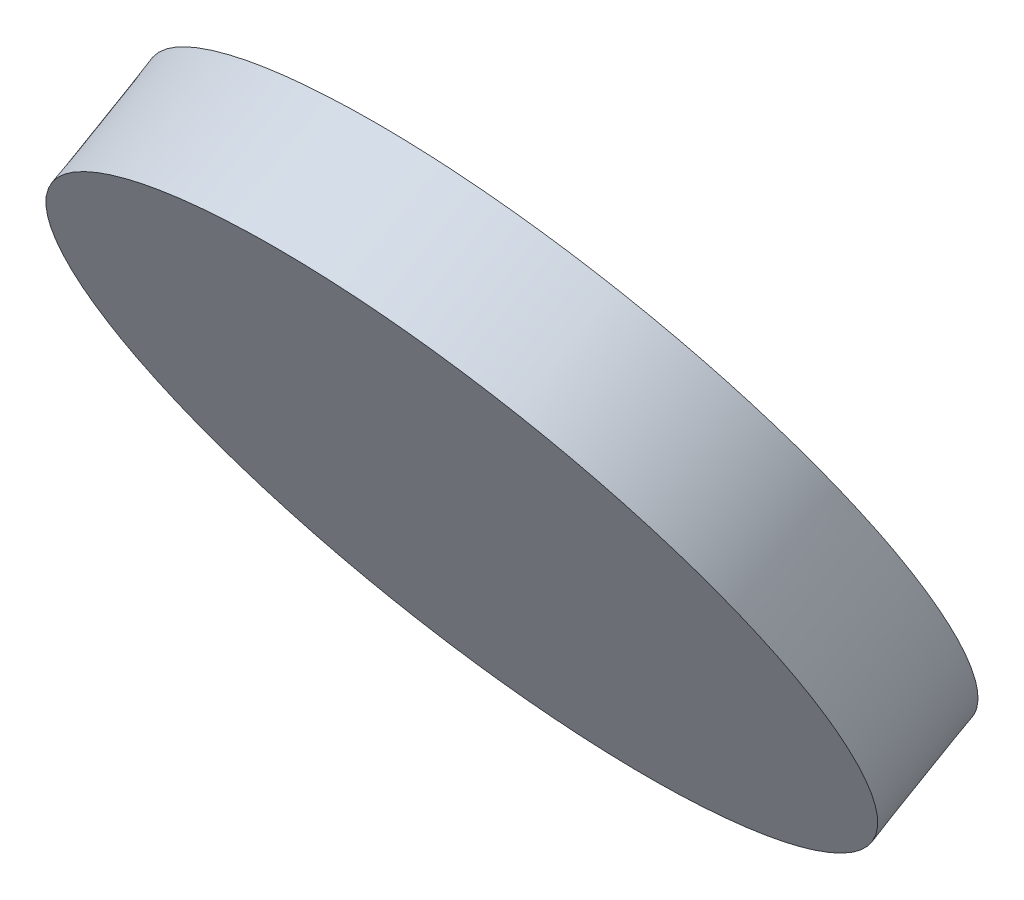
ISO-10303-21;
HEADER;
FILE_DESCRIPTION(('STEP AP214'),'2;1');
FILE_NAME('part.step','',(''),(''),'','','');
FILE_SCHEMA(('AUTOMOTIVE_DESIGN { 1 0 10303 214 1 1 1 1 }'));
ENDSEC;
DATA;
#1=APPLICATION_CONTEXT('core data for automotive mechanical design processes');
#2=APPLICATION_PROTOCOL_DEFINITION('international standard','automotive_design',2000,#1);
#3=PRODUCT_CONTEXT('',#1,'mechanical');
#4=PRODUCT('Part','Part','',(#3));
#5=PRODUCT_RELATED_PRODUCT_CATEGORY('part','',(#4));
#6=PRODUCT_DEFINITION_FORMATION('','',#4);
#7=PRODUCT_DEFINITION_CONTEXT('part definition',#1,'design');
#8=PRODUCT_DEFINITION('design','',#6,#7);
#9=PRODUCT_DEFINITION_SHAPE('','',#8);
#10=(LENGTH_UNIT() NAMED_UNIT(*) SI_UNIT(.MILLI.,.METRE.));
#11=(NAMED_UNIT(*) PLANE_ANGLE_UNIT() SI_UNIT($,.RADIAN.));
#12=(NAMED_UNIT(*) SI_UNIT($,.STERADIAN.) SOLID_ANGLE_UNIT());
#13=UNCERTAINTY_MEASURE_WITH_UNIT(LENGTH_MEASURE(1.E-05),#10,'distance_accuracy_value','');
#14=(GEOMETRIC_REPRESENTATION_CONTEXT(3) GLOBAL_UNCERTAINTY_ASSIGNED_CONTEXT((#13)) GLOBAL_UNIT_ASSIGNED_CONTEXT((#10,
#11,#12)) REPRESENTATION_CONTEXT('',''));
#15=CARTESIAN_POINT('',(0.,0.,0.));
#16=DIRECTION('',(0.,0.,1.));
#17=DIRECTION('',(1.,0.,0.));
#18=AXIS2_PLACEMENT_3D('',#15,#16,#17);
#19=CARTESIAN_POINT('',(-12.5,-8.26266717079047,-53.5328048076006));
#20=CARTESIAN_POINT('',(-12.3317700207924,-8.26266717079047,-53.5328048076006));
#21=CARTESIAN_POINT('',(-11.9953100623771,-8.32062682754336,-53.566267831029));
#22=CARTESIAN_POINT('',(-11.5674545927316,-8.56820953442885,-53.709209773496));
#23=CARTESIAN_POINT('',(-11.2815707077975,-8.93874324028998,-53.9231375083188));
#24=CARTESIAN_POINT('',(-11.1811816375123,-9.37581754730581,-54.1754824771302));
#25=CARTESIAN_POINT('',(-11.2815707077975,-9.81289185432164,-54.4278274459417));
#26=CARTESIAN_POINT('',(-11.5674545927316,-10.1834255601828,-54.6417551807644));
#27=CARTESIAN_POINT('',(-11.9953100623771,-10.4310082670682,-54.7846971232315));
#28=CARTESIAN_POINT('',(-12.5,-10.5179477521976,-54.8348916583741));
#29=CARTESIAN_POINT('',(-13.0046899376229,-10.4310082670682,-54.7846971232314));
#30=CARTESIAN_POINT('',(-13.4325454072684,-10.1834255601828,-54.6417551807644));
#31=CARTESIAN_POINT('',(-13.7184292922025,-9.81289185432163,-54.4278274459417));
#32=CARTESIAN_POINT('',(-13.8188183624877,-9.37581754730581,-54.1754824771302));
#33=CARTESIAN_POINT('',(-13.7184292922025,-8.93874324028998,-53.9231375083188));
#34=CARTESIAN_POINT('',(-13.4325454072684,-8.56820953442885,-53.7092097734961));
#35=CARTESIAN_POINT('',(-13.0046899376229,-8.32062682754336,-53.566267831029));
#36=CARTESIAN_POINT('',(-12.6682299792076,-8.26266717079047,-53.5328048076006));
#37=CARTESIAN_POINT('',(-12.5,-8.26266717079047,-53.5328048076006));
#38=B_SPLINE_CURVE_WITH_KNOTS('',3,(#19,#20,#21,#22,#23,#24,#25,#26,#27,#28,#29,#30,#31,#32,#33,
#34,#35,#36,#37),.UNSPECIFIED.,.T.,.F.,(4,1,1,1,1,1,1,1,1,1,1,1,1,1,1,1,4),(0.,
0.0624999999999999,0.125,0.1875,0.25,0.3125,0.375,0.4375,0.5,0.5625,0.625,0.6875,0.75,0.8125,
0.875,0.9375,1.),.UNSPECIFIED.);
#39=DIRECTION('',(0.,0.499999999999995,-0.866025403784442));
#40=VECTOR('',#39,1.);
#41=SURFACE_OF_LINEAR_EXTRUSION('',#38,#40);
#42=CARTESIAN_POINT('',(-12.5,-8.26266717079047,-53.5328048076006));
#43=CARTESIAN_POINT('',(-12.3317700207924,-8.26266717079047,-53.5328048076006));
#44=CARTESIAN_POINT('',(-11.9953100623771,-8.32062682754336,-53.566267831029));
#45=CARTESIAN_POINT('',(-11.5674545927316,-8.56820953442885,-53.709209773496));
#46=CARTESIAN_POINT('',(-11.2815707077975,-8.93874324028998,-53.9231375083188));
#47=CARTESIAN_POINT('',(-11.1811816375123,-9.3758175473058,-54.1754824771302));
#48=CARTESIAN_POINT('',(-11.2815707077975,-9.81289185432163,-54.4278274459417));
#49=CARTESIAN_POINT('',(-11.5674545927316,-10.1834255601828,-54.6417551807644));
#50=CARTESIAN_POINT('',(-11.9953100623771,-10.4310082670682,-54.7846971232315));
#51=CARTESIAN_POINT('',(-12.5,-10.5179477521976,-54.8348916583741));
#52=CARTESIAN_POINT('',(-13.0046899376229,-10.4310082670682,-54.7846971232315));
#53=CARTESIAN_POINT('',(-13.4325454072684,-10.1834255601828,-54.6417551807644));
#54=CARTESIAN_POINT('',(-13.7184292922025,-9.81289185432163,-54.4278274459417));
#55=CARTESIAN_POINT('',(-13.8188183624877,-9.3758175473058,-54.1754824771302));
#56=CARTESIAN_POINT('',(-13.7184292922025,-8.93874324028997,-53.9231375083188));
#57=CARTESIAN_POINT('',(-13.4325454072684,-8.56820953442885,-53.7092097734961));
#58=CARTESIAN_POINT('',(-13.0046899376229,-8.32062682754336,-53.566267831029));
#59=CARTESIAN_POINT('',(-12.6682299792076,-8.26266717079047,-53.5328048076006));
#60=CARTESIAN_POINT('',(-12.5,-8.26266717079047,-53.5328048076006));
#61=B_SPLINE_CURVE_WITH_KNOTS('',3,(#42,#43,#44,#45,#46,#47,#48,#49,#50,#51,#52,#53,#54,#55,#56,
#57,#58,#59,#60),.UNSPECIFIED.,.T.,.F.,(4,1,1,1,1,1,1,1,1,1,1,1,1,1,1,1,4),(0.,
0.0624999999999999,0.125,0.1875,0.25,0.3125,0.375,0.4375,0.5,0.5625,0.625,0.6875,0.75,0.8125,
0.875,0.9375,1.),.UNSPECIFIED.);
#62=CARTESIAN_POINT('',(-12.5,-8.26266717079047,-53.5328048076006));
#63=VERTEX_POINT('',#62);
#64=EDGE_CURVE('E10',#63,#63,#61,.T.);
#65=ORIENTED_EDGE('',*,*,#64,.T.);
#66=EDGE_LOOP('',(#65));
#67=FACE_BOUND('',#66,.T.);
#68=CARTESIAN_POINT('',(-12.5,-8.06266717079047,-53.8792149691144));
#69=CARTESIAN_POINT('',(-12.5210292435893,-8.06266715760592,-53.8792149615022));
#70=CARTESIAN_POINT('',(-12.5420580506909,-8.06312000040027,-53.8794764104115));
#71=CARTESIAN_POINT('',(-12.5840656469514,-8.06492263609273,-53.8805171626138));
#72=CARTESIAN_POINT('',(-12.605044433095,-8.06627248175939,-53.8812964963728));
#73=CARTESIAN_POINT('',(-12.6469017924796,-8.06986048239043,-53.883368029503));
#74=CARTESIAN_POINT('',(-12.6677803587443,-8.07209869831302,-53.8846602640684));
#75=CARTESIAN_POINT('',(-12.7093873858979,-8.07745482933055,-53.8877526277532));
#76=CARTESIAN_POINT('',(-12.7301158402734,-8.08057278236575,-53.8895527787774));
#77=CARTESIAN_POINT('',(-12.7713726611837,-8.08767981225891,-53.8936560243993));
#78=CARTESIAN_POINT('',(-12.7919010277185,-8.09166888911686,-53.8959591189971));
#79=CARTESIAN_POINT('',(-12.832707709252,-8.1005096065897,-53.9010633096098));
#80=CARTESIAN_POINT('',(-12.8529860349978,-8.10536120999344,-53.903864384141));
#81=CARTESIAN_POINT('',(-12.8932426430212,-8.11591841296738,-53.9099595881199));
#82=CARTESIAN_POINT('',(-12.9132209457939,-8.12162395390908,-53.9132536837184));
#83=CARTESIAN_POINT('',(-12.9528275830444,-8.13388047459254,-53.9203299892344));
#84=CARTESIAN_POINT('',(-12.9724559380415,-8.1404314045779,-53.9241121704249));
#85=CARTESIAN_POINT('',(-13.0113124478785,-8.1543699910942,-53.9321596171022));
#86=CARTESIAN_POINT('',(-13.0305406027184,-8.16175764762513,-53.936424882589));
#87=CARTESIAN_POINT('',(-13.06855413176,-8.17734499169158,-53.9454242398817));
#88=CARTESIAN_POINT('',(-13.0873394798451,-8.18554472697561,-53.9501583592552));
#89=CARTESIAN_POINT('',(-13.1244251203754,-8.20273169414932,-53.9600812593795));
#90=CARTESIAN_POINT('',(-13.1427253794428,-8.21171898004618,-53.9652700713114));
#91=CARTESIAN_POINT('',(-13.1787984767248,-8.23045653618613,-53.9760882043927));
#92=CARTESIAN_POINT('',(-13.1965712921558,-8.24020683932261,-53.9817175445332));
#93=CARTESIAN_POINT('',(-13.2315471338735,-8.26044594851342,-53.9934025996727));
#94=CARTESIAN_POINT('',(-13.2487501601601,-8.27093475456776,-53.9994583146717));
#95=CARTESIAN_POINT('',(-13.2825440403118,-8.2926264008623,-54.011981992499));
#96=CARTESIAN_POINT('',(-13.2991349205488,-8.3038292102856,-54.0184499375352));
#97=CARTESIAN_POINT('',(-13.331662109414,-8.32692438032456,-54.0317839401742));
#98=CARTESIAN_POINT('',(-13.3475984628843,-8.33881669356689,-54.0386499704259));
#99=CARTESIAN_POINT('',(-13.3787742546724,-8.36326641938701,-54.0527660262098));
#100=CARTESIAN_POINT('',(-13.3940137339341,-8.37582379279626,-54.0600160291279));
#101=CARTESIAN_POINT('',(-13.4237532190322,-8.40157894238665,-54.074885771677));
#102=CARTESIAN_POINT('',(-13.4382532248685,-8.41477671856779,-54.0825055113079));
#103=CARTESIAN_POINT('',(-13.4664853364362,-8.44177574623937,-54.0980934072019));
#104=CARTESIAN_POINT('',(-13.4802173969397,-8.45557703318831,-54.106061583937));
#105=CARTESIAN_POINT('',(-13.5068854022177,-8.48374640505931,-54.1223251783696));
#106=CARTESIAN_POINT('',(-13.5198212922901,-8.49811452881567,-54.1306206184881));
#107=CARTESIAN_POINT('',(-13.5448686479447,-8.52738088751947,-54.147517558564));
#108=CARTESIAN_POINT('',(-13.5569800779426,-8.5422791453057,-54.1561190717073));
#109=CARTESIAN_POINT('',(-13.5803501882216,-8.57256911275189,-54.1736069925661));
#110=CARTESIAN_POINT('',(-13.5916088685026,-8.58796082241186,-54.1824934002816));
#111=CARTESIAN_POINT('',(-13.6132451346653,-8.61920104105146,-54.2005299489227));
#112=CARTESIAN_POINT('',(-13.623622758529,-8.6350495303,-54.2096800784566));
#113=CARTESIAN_POINT('',(-13.6434685587776,-8.66716663711403,-54.2282228987212));
#114=CARTESIAN_POINT('',(-13.6529367975248,-8.6834352257735,-54.2376155727631));
#115=CARTESIAN_POINT('',(-13.67093551211,-8.71635590761411,-54.2566223372857));
#116=CARTESIAN_POINT('',(-13.6794660430833,-8.7330079781776,-54.2662364147081));
#117=CARTESIAN_POINT('',(-13.6955609364387,-8.76665870278725,-54.2856646696199));
#118=CARTESIAN_POINT('',(-13.7031252988208,-8.78365735683341,-54.2954788471093));
#119=CARTESIAN_POINT('',(-13.7172779098496,-8.81795771089412,-54.3152821657596));
#120=CARTESIAN_POINT('',(-13.7238661010426,-8.83525942867889,-54.32527131718));
#121=CARTESIAN_POINT('',(-13.7360565090117,-8.87012267373578,-54.3453996210985));
#122=CARTESIAN_POINT('',(-13.7416586580894,-8.88768421875711,-54.3555387838439));
#123=CARTESIAN_POINT('',(-13.7518670392729,-8.92302384221233,-54.3759421249588));
#124=CARTESIAN_POINT('',(-13.7564732284109,-8.94080192995338,-54.3862063087018));
#125=CARTESIAN_POINT('',(-13.7646797198118,-8.97653138269051,-54.4068347178576));
#126=CARTESIAN_POINT('',(-13.7682800220747,-8.99448274768658,-54.4171989432704));
#127=CARTESIAN_POINT('',(-13.7744647488583,-9.03051549857665,-54.4380024616964));
#128=CARTESIAN_POINT('',(-13.7770492171889,-9.04859687882925,-54.4484417514526));
#129=CARTESIAN_POINT('',(-13.7811922856357,-9.08484638404821,-54.4693704130487));
#130=CARTESIAN_POINT('',(-13.7827509561402,-9.10301450297655,-54.4798597814027));
#131=CARTESIAN_POINT('',(-13.7848324523857,-9.13939426545413,-54.5008636470622));
#132=CARTESIAN_POINT('',(-13.7853553390593,-9.15760590637997,-54.5113781428531));
#133=CARTESIAN_POINT('',(-13.7853553390593,-9.19402918823164,-54.5324071344349));
#134=CARTESIAN_POINT('',(-13.7848324523857,-9.21224082915747,-54.5429216302259));
#135=CARTESIAN_POINT('',(-13.7827509561402,-9.24862059163506,-54.5639254958853));
#136=CARTESIAN_POINT('',(-13.7811922856357,-9.2667887105634,-54.5744148642393));
#137=CARTESIAN_POINT('',(-13.7770492171889,-9.30303821578236,-54.5953435258354));
#138=CARTESIAN_POINT('',(-13.7744647488583,-9.32111959603495,-54.6057828155916));
#139=CARTESIAN_POINT('',(-13.7682800220747,-9.35715234692502,-54.6265863340176));
#140=CARTESIAN_POINT('',(-13.7646797198118,-9.3751037119211,-54.6369505594304));
#141=CARTESIAN_POINT('',(-13.7564732284109,-9.41083316465823,-54.6575789685862));
#142=CARTESIAN_POINT('',(-13.7518670392729,-9.42861125239928,-54.6678431523292));
#143=CARTESIAN_POINT('',(-13.7416586580894,-9.4639508758545,-54.6882464934441));
#144=CARTESIAN_POINT('',(-13.7360565090117,-9.48151242087583,-54.6983856561895));
#145=CARTESIAN_POINT('',(-13.7238661010426,-9.51637566593271,-54.718513960108));
#146=CARTESIAN_POINT('',(-13.7172779098496,-9.53367738371748,-54.7285031115284));
#147=CARTESIAN_POINT('',(-13.7031252988208,-9.56797773777819,-54.7483064301787));
#148=CARTESIAN_POINT('',(-13.6955609364387,-9.58497639182436,-54.7581206076681));
#149=CARTESIAN_POINT('',(-13.6794660430833,-9.618627116434,-54.7775488625799));
#150=CARTESIAN_POINT('',(-13.67093551211,-9.6352791869975,-54.7871629400023));
#151=CARTESIAN_POINT('',(-13.6529367975248,-9.6681998688381,-54.8061697045249));
#152=CARTESIAN_POINT('',(-13.6434685587776,-9.68446845749758,-54.8155623785668));
#153=CARTESIAN_POINT('',(-13.623622758529,-9.71658556431161,-54.8341051988315));
#154=CARTESIAN_POINT('',(-13.6132451346653,-9.73243405356014,-54.8432553283653));
#155=CARTESIAN_POINT('',(-13.5916088685026,-9.76367427219975,-54.8612918770065));
#156=CARTESIAN_POINT('',(-13.5803501882216,-9.77906598185971,-54.8701782847219));
#157=CARTESIAN_POINT('',(-13.5569800779426,-9.80935594930591,-54.8876662055807));
#158=CARTESIAN_POINT('',(-13.5448686479447,-9.82425420709214,-54.8962677187241));
#159=CARTESIAN_POINT('',(-13.5198212922901,-9.85352056579594,-54.9131646587999));
#160=CARTESIAN_POINT('',(-13.5068854022177,-9.86788868955229,-54.9214600989184));
#161=CARTESIAN_POINT('',(-13.4802173969397,-9.8960580614233,-54.937723693351));
#162=CARTESIAN_POINT('',(-13.4664853364362,-9.90985934837224,-54.9456918700862));
#163=CARTESIAN_POINT('',(-13.4382532248685,-9.93685837604382,-54.9612797659802));
#164=CARTESIAN_POINT('',(-13.4237532190322,-9.95005615222496,-54.9688995056111));
#165=CARTESIAN_POINT('',(-13.3940137339342,-9.97581130181535,-54.9837692481601));
#166=CARTESIAN_POINT('',(-13.3787742546724,-9.9883686752246,-54.9910192510783));
#167=CARTESIAN_POINT('',(-13.3475984628843,-10.0128184010447,-55.0051353068621));
#168=CARTESIAN_POINT('',(-13.331662109414,-10.024710714287,-55.0120013371139));
#169=CARTESIAN_POINT('',(-13.2991349205488,-10.047805884326,-55.0253353397528));
#170=CARTESIAN_POINT('',(-13.2825440403118,-10.0590086937493,-55.0318032847891));
#171=CARTESIAN_POINT('',(-13.2487501601601,-10.0807003400438,-55.0443269626164));
#172=CARTESIAN_POINT('',(-13.2315471338735,-10.0911891460982,-55.0503826776153));
#173=CARTESIAN_POINT('',(-13.1965712921558,-10.111428255289,-55.0620677327548));
#174=CARTESIAN_POINT('',(-13.1787984767249,-10.1211785584255,-55.0676970728953));
#175=CARTESIAN_POINT('',(-13.1427253794427,-10.1399161145654,-55.0785152059767));
#176=CARTESIAN_POINT('',(-13.1244251203749,-10.1489034004623,-55.0837040179085));
#177=CARTESIAN_POINT('',(-13.0873394798455,-10.166090367636,-55.0936269180328));
#178=CARTESIAN_POINT('',(-13.0685541317618,-10.1742901029201,-55.0983610374064));
#179=CARTESIAN_POINT('',(-13.0305406027166,-10.1898774469864,-55.107360394699));
#180=CARTESIAN_POINT('',(-13.0113124478718,-10.197265103517,-55.1116256601857));
#181=CARTESIAN_POINT('',(-12.9724559380482,-10.211203690034,-55.1196731068634));
#182=CARTESIAN_POINT('',(-12.9528275830694,-10.2177546200204,-55.1234552880544));
#183=CARTESIAN_POINT('',(-12.9132209457689,-10.2300111407012,-55.1305315935688));
#184=CARTESIAN_POINT('',(-12.8932426429279,-10.2357166816393,-55.1338256891653));
#185=CARTESIAN_POINT('',(-12.8529860350911,-10.246273884623,-55.1399208931499));
#186=CARTESIAN_POINT('',(-12.8327077096002,-10.2511254880401,-55.1427219676887));
#187=CARTESIAN_POINT('',(-12.7919010273703,-10.2599662054765,-55.1478261582804));
#188=CARTESIAN_POINT('',(-12.7713726598844,-10.2639552822847,-55.1501292528495));
#189=CARTESIAN_POINT('',(-12.7301158415728,-10.2710623123138,-55.1542324985499));
#190=CARTESIAN_POINT('',(-12.7093873907472,-10.2741802655348,-55.1560326496814));
#191=CARTESIAN_POINT('',(-12.6677803538952,-10.2795363960449,-55.1591250130732));
#192=CARTESIAN_POINT('',(-12.6469017743828,-10.2817746112744,-55.1604172472384));
#193=CARTESIAN_POINT('',(-12.6050444511905,-10.2853626137989,-55.1624887814618));
#194=CARTESIAN_POINT('',(-12.5840657144826,-10.286712462052,-55.1632681167141));
#195=CARTESIAN_POINT('',(-12.5420579831637,-10.2885150906784,-55.1643088648368));
#196=CARTESIAN_POINT('',(-12.5210289915818,-10.2889679238211,-55.1645703081737));
#197=CARTESIAN_POINT('',(-12.4789710084182,-10.2889679238211,-55.1645703081737));
#198=CARTESIAN_POINT('',(-12.4579420168363,-10.2885150906784,-55.1643088648368));
#199=CARTESIAN_POINT('',(-12.4159342855174,-10.286712462052,-55.1632681167141));
#200=CARTESIAN_POINT('',(-12.3949555488095,-10.2853626137989,-55.1624887814618));
#201=CARTESIAN_POINT('',(-12.3530982256172,-10.2817746112744,-55.1604172472384));
#202=CARTESIAN_POINT('',(-12.3322196461048,-10.2795363960449,-55.1591250130732));
#203=CARTESIAN_POINT('',(-12.2906126092528,-10.2741802655348,-55.1560326496814));
#204=CARTESIAN_POINT('',(-12.2698841584272,-10.2710623123138,-55.1542324985499));
#205=CARTESIAN_POINT('',(-12.2286273401156,-10.2639552822847,-55.1501292528495));
#206=CARTESIAN_POINT('',(-12.2080989726297,-10.2599662054765,-55.1478261582804));
#207=CARTESIAN_POINT('',(-12.1672922903998,-10.2511254880401,-55.1427219676887));
#208=CARTESIAN_POINT('',(-12.1470139649089,-10.246273884623,-55.1399208931499));
#209=CARTESIAN_POINT('',(-12.1067573570721,-10.2357166816393,-55.1338256891653));
#210=CARTESIAN_POINT('',(-12.0867790542311,-10.2300111407012,-55.1305315935688));
#211=CARTESIAN_POINT('',(-12.0471724169306,-10.2177546200204,-55.1234552880544));
#212=CARTESIAN_POINT('',(-12.0275440619518,-10.211203690034,-55.1196731068634));
#213=CARTESIAN_POINT('',(-11.9886875521282,-10.197265103517,-55.1116256601857));
#214=CARTESIAN_POINT('',(-11.9694593972834,-10.1898774469864,-55.107360394699));
#215=CARTESIAN_POINT('',(-11.9314458682382,-10.1742901029201,-55.0983610374064));
#216=CARTESIAN_POINT('',(-11.9126605201545,-10.166090367636,-55.0936269180328));
#217=CARTESIAN_POINT('',(-11.8755748796251,-10.1489034004623,-55.0837040179085));
#218=CARTESIAN_POINT('',(-11.8572746205573,-10.1399161145654,-55.0785152059767));
#219=CARTESIAN_POINT('',(-11.8212015232751,-10.1211785584255,-55.0676970728953));
#220=CARTESIAN_POINT('',(-11.8034287078442,-10.111428255289,-55.0620677327548));
#221=CARTESIAN_POINT('',(-11.7684528661265,-10.0911891460982,-55.0503826776153));
#222=CARTESIAN_POINT('',(-11.7512498398399,-10.0807003400438,-55.0443269626164));
#223=CARTESIAN_POINT('',(-11.7174559596882,-10.0590086937493,-55.0318032847891));
#224=CARTESIAN_POINT('',(-11.7008650794512,-10.047805884326,-55.0253353397528));
#225=CARTESIAN_POINT('',(-11.668337890586,-10.024710714287,-55.0120013371139));
#226=CARTESIAN_POINT('',(-11.6524015371157,-10.0128184010447,-55.0051353068621));
#227=CARTESIAN_POINT('',(-11.6212257453276,-9.9883686752246,-54.9910192510783));
#228=CARTESIAN_POINT('',(-11.6059862660658,-9.97581130181535,-54.9837692481601));
#229=CARTESIAN_POINT('',(-11.5762467809678,-9.95005615222496,-54.9688995056111));
#230=CARTESIAN_POINT('',(-11.5617467751315,-9.93685837604382,-54.9612797659802));
#231=CARTESIAN_POINT('',(-11.5335146635638,-9.90985934837224,-54.9456918700862));
#232=CARTESIAN_POINT('',(-11.5197826030603,-9.8960580614233,-54.937723693351));
#233=CARTESIAN_POINT('',(-11.4931145977823,-9.86788868955229,-54.9214600989184));
#234=CARTESIAN_POINT('',(-11.4801787077099,-9.85352056579594,-54.9131646587999));
#235=CARTESIAN_POINT('',(-11.4551313520553,-9.82425420709214,-54.8962677187241));
#236=CARTESIAN_POINT('',(-11.4430199220574,-9.80935594930591,-54.8876662055807));
#237=CARTESIAN_POINT('',(-11.4196498117784,-9.77906598185971,-54.8701782847219));
#238=CARTESIAN_POINT('',(-11.4083911314974,-9.76367427219975,-54.8612918770065));
#239=CARTESIAN_POINT('',(-11.3867548653347,-9.73243405356015,-54.8432553283653));
#240=CARTESIAN_POINT('',(-11.376377241471,-9.71658556431161,-54.8341051988315));
#241=CARTESIAN_POINT('',(-11.3565314412224,-9.68446845749758,-54.8155623785668));
#242=CARTESIAN_POINT('',(-11.3470632024752,-9.66819986883811,-54.8061697045249));
#243=CARTESIAN_POINT('',(-11.32906448789,-9.6352791869975,-54.7871629400023));
#244=CARTESIAN_POINT('',(-11.3205339569167,-9.61862711643401,-54.7775488625799));
#245=CARTESIAN_POINT('',(-11.3044390635613,-9.58497639182436,-54.7581206076681));
#246=CARTESIAN_POINT('',(-11.2968747011792,-9.5679777377782,-54.7483064301787));
#247=CARTESIAN_POINT('',(-11.2827220901504,-9.53367738371749,-54.7285031115284));
#248=CARTESIAN_POINT('',(-11.2761338989574,-9.51637566593271,-54.718513960108));
#249=CARTESIAN_POINT('',(-11.2639434909883,-9.48151242087583,-54.6983856561896));
#250=CARTESIAN_POINT('',(-11.2583413419106,-9.4639508758545,-54.6882464934441));
#251=CARTESIAN_POINT('',(-11.2481329607271,-9.42861125239928,-54.6678431523292));
#252=CARTESIAN_POINT('',(-11.2435267715891,-9.41083316465823,-54.6575789685862));
#253=CARTESIAN_POINT('',(-11.2353202801882,-9.3751037119211,-54.6369505594304));
#254=CARTESIAN_POINT('',(-11.2317199779253,-9.35715234692503,-54.6265863340176));
#255=CARTESIAN_POINT('',(-11.2255352511417,-9.32111959603496,-54.6057828155916));
#256=CARTESIAN_POINT('',(-11.2229507828111,-9.30303821578236,-54.5953435258354));
#257=CARTESIAN_POINT('',(-11.2188077143643,-9.2667887105634,-54.5744148642393));
#258=CARTESIAN_POINT('',(-11.2172490438598,-9.24862059163506,-54.5639254958853));
#259=CARTESIAN_POINT('',(-11.2151675476143,-9.21224082915748,-54.5429216302258));
#260=CARTESIAN_POINT('',(-11.2146446609407,-9.19402918823164,-54.5324071344349));
#261=CARTESIAN_POINT('',(-11.2146446609407,-9.15760590637997,-54.5113781428531));
#262=CARTESIAN_POINT('',(-11.2151675476143,-9.13939426545413,-54.5008636470622));
#263=CARTESIAN_POINT('',(-11.2172490438598,-9.10301450297655,-54.4798597814027));
#264=CARTESIAN_POINT('',(-11.2188077143643,-9.08484638404821,-54.4693704130487));
#265=CARTESIAN_POINT('',(-11.2229507828111,-9.04859687882925,-54.4484417514526));
#266=CARTESIAN_POINT('',(-11.2255352511416,-9.03051549857665,-54.4380024616964));
#267=CARTESIAN_POINT('',(-11.2317199779253,-8.99448274768658,-54.4171989432704));
#268=CARTESIAN_POINT('',(-11.2353202801882,-8.97653138269051,-54.4068347178576));
#269=CARTESIAN_POINT('',(-11.2435267715891,-8.94080192995338,-54.3862063087018));
#270=CARTESIAN_POINT('',(-11.2481329607271,-8.92302384221233,-54.3759421249589));
#271=CARTESIAN_POINT('',(-11.2583413419106,-8.88768421875711,-54.3555387838439));
#272=CARTESIAN_POINT('',(-11.2639434909883,-8.87012267373578,-54.3453996210985));
#273=CARTESIAN_POINT('',(-11.2761338989574,-8.83525942867889,-54.3252713171801));
#274=CARTESIAN_POINT('',(-11.2827220901504,-8.81795771089412,-54.3152821657596));
#275=CARTESIAN_POINT('',(-11.2968747011792,-8.78365735683341,-54.2954788471093));
#276=CARTESIAN_POINT('',(-11.3044390635613,-8.76665870278725,-54.2856646696199));
#277=CARTESIAN_POINT('',(-11.3205339569167,-8.7330079781776,-54.2662364147081));
#278=CARTESIAN_POINT('',(-11.32906448789,-8.71635590761411,-54.2566223372857));
#279=CARTESIAN_POINT('',(-11.3470632024752,-8.68343522577351,-54.2376155727631));
#280=CARTESIAN_POINT('',(-11.3565314412224,-8.66716663711403,-54.2282228987212));
#281=CARTESIAN_POINT('',(-11.376377241471,-8.6350495303,-54.2096800784566));
#282=CARTESIAN_POINT('',(-11.3867548653347,-8.61920104105146,-54.2005299489227));
#283=CARTESIAN_POINT('',(-11.4083911314974,-8.58796082241186,-54.1824934002816));
#284=CARTESIAN_POINT('',(-11.4196498117784,-8.57256911275189,-54.1736069925661));
#285=CARTESIAN_POINT('',(-11.4430199220574,-8.5422791453057,-54.1561190717073));
#286=CARTESIAN_POINT('',(-11.4551313520553,-8.52738088751947,-54.147517558564));
#287=CARTESIAN_POINT('',(-11.4801787077099,-8.49811452881567,-54.1306206184881));
#288=CARTESIAN_POINT('',(-11.4931145977823,-8.48374640505931,-54.1223251783696));
#289=CARTESIAN_POINT('',(-11.5197826030603,-8.45557703318831,-54.106061583937));
#290=CARTESIAN_POINT('',(-11.5335146635638,-8.44177574623937,-54.0980934072019));
#291=CARTESIAN_POINT('',(-11.5617467751315,-8.41477671856779,-54.0825055113078));
#292=CARTESIAN_POINT('',(-11.5762467809678,-8.40157894238665,-54.074885771677));
#293=CARTESIAN_POINT('',(-11.6059862660659,-8.37582379279626,-54.0600160291279));
#294=CARTESIAN_POINT('',(-11.6212257453276,-8.36326641938701,-54.0527660262098));
#295=CARTESIAN_POINT('',(-11.6524015371157,-8.33881669356689,-54.0386499704259));
#296=CARTESIAN_POINT('',(-11.668337890586,-8.32692438032456,-54.0317839401742));
#297=CARTESIAN_POINT('',(-11.7008650794512,-8.3038292102856,-54.0184499375352));
#298=CARTESIAN_POINT('',(-11.7174559596882,-8.2926264008623,-54.011981992499));
#299=CARTESIAN_POINT('',(-11.7512498398399,-8.27093475456776,-53.9994583146716));
#300=CARTESIAN_POINT('',(-11.7684528661265,-8.26044594851342,-53.9934025996727));
#301=CARTESIAN_POINT('',(-11.8034287078442,-8.24020683932261,-53.9817175445332));
#302=CARTESIAN_POINT('',(-11.8212015232752,-8.23045653618613,-53.9760882043927));
#303=CARTESIAN_POINT('',(-11.8572746205572,-8.21171898004618,-53.9652700713114));
#304=CARTESIAN_POINT('',(-11.8755748796246,-8.20273169414932,-53.9600812593795));
#305=CARTESIAN_POINT('',(-11.9126605201549,-8.18554472697561,-53.9501583592552));
#306=CARTESIAN_POINT('',(-11.93144586824,-8.17734499169158,-53.9454242398817));
#307=CARTESIAN_POINT('',(-11.9694593972816,-8.16175764762514,-53.936424882589));
#308=CARTESIAN_POINT('',(-11.9886875521215,-8.1543699910942,-53.9321596171022));
#309=CARTESIAN_POINT('',(-12.0275440619585,-8.14043140457791,-53.9241121704249));
#310=CARTESIAN_POINT('',(-12.0471724169556,-8.13388047459254,-53.9203299892344));
#311=CARTESIAN_POINT('',(-12.0867790542061,-8.12162395390908,-53.9132536837185));
#312=CARTESIAN_POINT('',(-12.1067573569788,-8.11591841296738,-53.9099595881199));
#313=CARTESIAN_POINT('',(-12.1470139650022,-8.10536120999345,-53.903864384141));
#314=CARTESIAN_POINT('',(-12.167292290748,-8.1005096065897,-53.9010633096098));
#315=CARTESIAN_POINT('',(-12.2080989722815,-8.09166888911687,-53.8959591189971));
#316=CARTESIAN_POINT('',(-12.2286273388163,-8.08767981225892,-53.8936560243993));
#317=CARTESIAN_POINT('',(-12.2698841597266,-8.08057278236576,-53.8895527787774));
#318=CARTESIAN_POINT('',(-12.2906126141021,-8.07745482933055,-53.8877526277532));
#319=CARTESIAN_POINT('',(-12.3322196412557,-8.07209869831302,-53.8846602640684));
#320=CARTESIAN_POINT('',(-12.3530982075204,-8.06986048239043,-53.883368029503));
#321=CARTESIAN_POINT('',(-12.394955566905,-8.0662724817594,-53.8812964963728));
#322=CARTESIAN_POINT('',(-12.4159343530486,-8.06492263609273,-53.8805171626138));
#323=CARTESIAN_POINT('',(-12.4579419493091,-8.06312000040027,-53.8794764104115));
#324=CARTESIAN_POINT('',(-12.4789707564107,-8.06266715760592,-53.8792149615022));
#325=CARTESIAN_POINT('',(-12.5,-8.06266717079047,-53.8792149691144));
#326=B_SPLINE_CURVE_WITH_KNOTS('',3,(#68,#69,#70,#71,#72,#73,#74,#75,#76,#77,#78,#79,#80,#81,
#82,#83,#84,#85,#86,#87,#88,#89,#90,#91,#92,#93,#94,#95,#96,#97,#98,#99,#100,#101,#102,#103,
#104,#105,#106,#107,#108,#109,#110,#111,#112,#113,#114,#115,#116,#117,#118,#119,#120,#121,#122,
#123,#124,#125,#126,#127,#128,#129,#130,#131,#132,#133,#134,#135,#136,#137,#138,#139,#140,#141,
#142,#143,#144,#145,#146,#147,#148,#149,#150,#151,#152,#153,#154,#155,#156,#157,#158,#159,#160,
#161,#162,#163,#164,#165,#166,#167,#168,#169,#170,#171,#172,#173,#174,#175,#176,#177,#178,#179,
#180,#181,#182,#183,#184,#185,#186,#187,#188,#189,#190,#191,#192,#193,#194,#195,#196,#197,#198,
#199,#200,#201,#202,#203,#204,#205,#206,#207,#208,#209,#210,#211,#212,#213,#214,#215,#216,#217,
#218,#219,#220,#221,#222,#223,#224,#225,#226,#227,#228,#229,#230,#231,#232,#233,#234,#235,#236,
#237,#238,#239,#240,#241,#242,#243,#244,#245,#246,#247,#248,#249,#250,#251,#252,#253,#254,#255,
#256,#257,#258,#259,#260,#261,#262,#263,#264,#265,#266,#267,#268,#269,#270,#271,#272,#273,#274,
#275,#276,#277,#278,#279,#280,#281,#282,#283,#284,#285,#286,#287,#288,#289,#290,#291,#292,#293,
#294,#295,#296,#297,#298,#299,#300,#301,#302,#303,#304,#305,#306,#307,#308,#309,#310,#311,#312,
#313,#314,#315,#316,#317,#318,#319,#320,#321,#322,#323,#324,#325),.UNSPECIFIED.,.F.,.F.,(4,2,2,
2,2,2,2,2,2,2,2,2,2,2,2,2,2,2,2,2,2,2,2,2,2,2,2,2,2,2,2,2,2,2,2,2,2,2,2,2,2,2,2,2,2,2,2,2,2,2,2,
2,2,2,2,2,2,2,2,2,2,2,2,2,2,2,2,2,2,2,2,2,2,2,2,2,2,2,2,2,2,2,2,2,2,2,2,2,2,2,2,2,2,2,2,2,2,2,2,
2,2,2,2,2,2,2,2,2,2,2,2,2,2,2,2,2,2,2,2,2,2,2,2,2,2,2,2,2,4),(0.,0.0630806127990775,
0.126164936809588,0.189253590290847,0.25234496500165,0.315436339712454,0.378524993193713,
0.441609317204223,0.504689930003303,0.567770542802381,0.630854866812893,0.693943520294151,
0.757034895004959,0.820126269715764,0.883214923197026,0.946299247207534,1.00937986000661,
1.0724604728057,1.1355447968162,1.19863345029746,1.26172482500826,1.32481619971907,
1.38790485320032,1.45098917721084,1.51406979000991,1.57715040280898,1.64023472681949,
1.70332338030075,1.76641475501156,1.82950612972236,1.89259478320363,1.95567910721414,
2.01875972001322,2.0818403328123,2.1449246568228,2.20801331030406,2.27110468501487,
2.33419605972568,2.39728471320693,2.46036903721744,2.52344965001652,2.5865302628156,
2.64961458682611,2.71270324030736,2.77579461501817,2.83888598972898,2.90197464321024,
2.96505896722075,3.02813958001983,3.09122019281891,3.15430451682942,3.21739317031067,
3.28048454502148,3.34357591973229,3.40666457321354,3.46974889722406,3.53282951002313,
3.59591012282221,3.65899444683272,3.72208310031398,3.78517447502478,3.84826584973559,
3.91135450321685,3.97443882722736,4.03751944002643,4.10060005282551,4.16368437683603,
4.22677303031728,4.28986440502809,4.3529557797389,4.41604443322015,4.47912875723067,
4.54220937002974,4.60528998282882,4.66837430683933,4.73146296032059,4.7945543350314,
4.8576457097422,4.92073436322346,4.98381868723397,5.04689930003305,5.10997991283213,
5.17306423684264,5.2361528903239,5.2992442650347,5.36233563974551,5.42542429322677,
5.48850861723728,5.55158923003635,5.61466984283543,5.67775416684594,5.7408428203272,
5.803934195038,5.86702556974881,5.93011422323007,5.99319854724058,6.05627916003966,
6.11935977283873,6.18244409684925,6.2455327503305,6.30862412504131,6.37171549975212,
6.43480415323338,6.49788847724388,6.56096909004296,6.62404970284204,6.68713402685255,
6.75022268033381,6.81331405504462,6.87640542975542,6.93949408323668,7.00257840724719,
7.06565902004627,7.12873963284535,7.19182395685586,7.25491261033711,7.31800398504792,
7.38109535975873,7.44418401323999,7.50726833725049,7.57034895004957,7.63342956284865,
7.69651388685916,7.75960254034042,7.82269391505123,7.88578528976203,7.94887394324329,
8.0119582672538,8.07503888005288),.UNSPECIFIED.);
#327=CARTESIAN_POINT('',(-12.5,-8.06266717079047,-53.8792149691144));
#328=VERTEX_POINT('',#327);
#329=EDGE_CURVE('E25',#328,#328,#326,.F.);
#330=ORIENTED_EDGE('',*,*,#329,.F.);
#331=EDGE_LOOP('',(#330));
#332=FACE_BOUND('',#331,.T.);
#333=ADVANCED_FACE('F15',(#67,#332),#41,.T.);
#334=CARTESIAN_POINT('',(0.,-10.4583493020364,-54.8004824771302));
#335=DIRECTION('',(0.,0.499999999999995,-0.866025403784442));
#336=DIRECTION('',(-1.,0.,0.));
#337=AXIS2_PLACEMENT_3D('',#334,#335,#336);
#338=PLANE('',#337);
#339=ORIENTED_EDGE('',*,*,#64,.F.);
#340=EDGE_LOOP('',(#339));
#341=FACE_BOUND('',#340,.T.);
#342=ADVANCED_FACE('F63',(#341),#338,.F.);
#343=CARTESIAN_POINT('',(0.,-10.2583493020364,-55.146892638644));
#344=DIRECTION('',(0.,0.499999999999995,-0.866025403784442));
#345=DIRECTION('',(-1.,0.,0.));
#346=AXIS2_PLACEMENT_3D('',#343,#344,#345);
#347=PLANE('',#346);
#348=ORIENTED_EDGE('',*,*,#329,.T.);
#349=EDGE_LOOP('',(#348));
#350=FACE_BOUND('',#349,.T.);
#351=ADVANCED_FACE('F32',(#350),#347,.T.);
#352=CLOSED_SHELL('',(#333,#342,#351));
#353=MANIFOLD_SOLID_BREP('B1',#352);
#354=ADVANCED_BREP_SHAPE_REPRESENTATION('',(#18,#353),#14);
#355=SHAPE_DEFINITION_REPRESENTATION(#9,#354);
ENDSEC;
END-ISO-10303-21;
